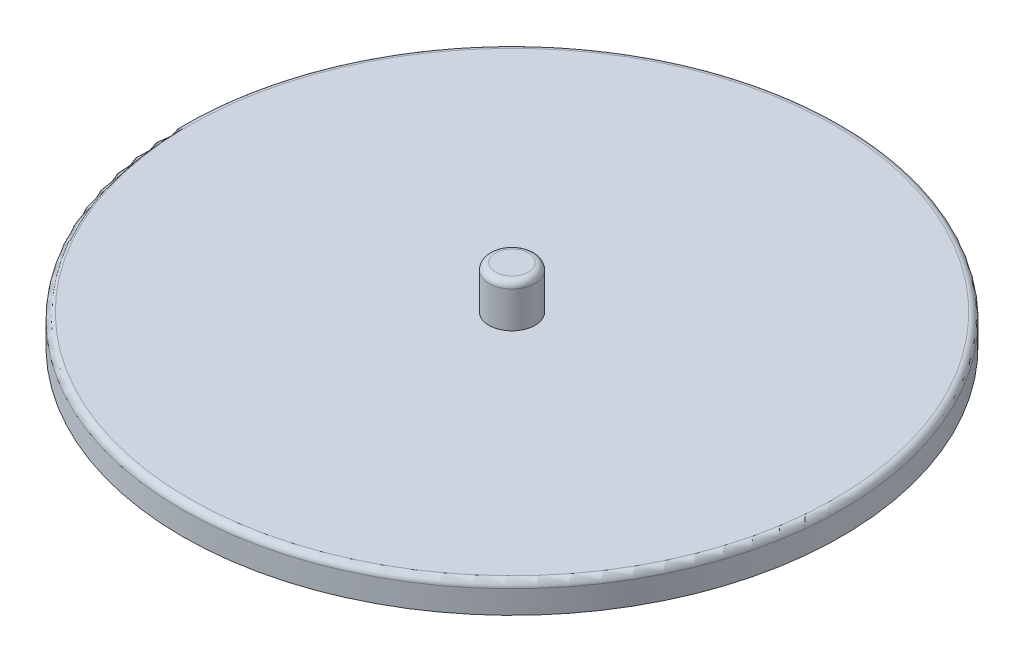
ISO-10303-21;
HEADER;
FILE_DESCRIPTION(('STEP AP214'),'2;1');
FILE_NAME('part.step','',(''),(''),'','','');
FILE_SCHEMA(('AUTOMOTIVE_DESIGN { 1 0 10303 214 1 1 1 1 }'));
ENDSEC;
DATA;
#1=APPLICATION_CONTEXT('core data for automotive mechanical design processes');
#2=APPLICATION_PROTOCOL_DEFINITION('international standard','automotive_design',2000,#1);
#3=PRODUCT_CONTEXT('',#1,'mechanical');
#4=PRODUCT('Part','Part','',(#3));
#5=PRODUCT_RELATED_PRODUCT_CATEGORY('part','',(#4));
#6=PRODUCT_DEFINITION_FORMATION('','',#4);
#7=PRODUCT_DEFINITION_CONTEXT('part definition',#1,'design');
#8=PRODUCT_DEFINITION('design','',#6,#7);
#9=PRODUCT_DEFINITION_SHAPE('','',#8);
#10=(LENGTH_UNIT() NAMED_UNIT(*) SI_UNIT(.MILLI.,.METRE.));
#11=(NAMED_UNIT(*) PLANE_ANGLE_UNIT() SI_UNIT($,.RADIAN.));
#12=(NAMED_UNIT(*) SI_UNIT($,.STERADIAN.) SOLID_ANGLE_UNIT());
#13=UNCERTAINTY_MEASURE_WITH_UNIT(LENGTH_MEASURE(1.E-05),#10,'distance_accuracy_value','');
#14=(GEOMETRIC_REPRESENTATION_CONTEXT(3) GLOBAL_UNCERTAINTY_ASSIGNED_CONTEXT((#13)) GLOBAL_UNIT_ASSIGNED_CONTEXT((#10,
#11,#12)) REPRESENTATION_CONTEXT('',''));
#15=CARTESIAN_POINT('',(0.,0.,0.));
#16=DIRECTION('',(0.,0.,1.));
#17=DIRECTION('',(1.,0.,0.));
#18=AXIS2_PLACEMENT_3D('',#15,#16,#17);
#19=CARTESIAN_POINT('',(0.,9.,0.));
#20=DIRECTION('',(0.,-1.,0.));
#21=DIRECTION('',(0.,0.,-1.));
#22=AXIS2_PLACEMENT_3D('',#19,#20,#21);
#23=CYLINDRICAL_SURFACE('',#22,99.9999999999943);
#24=CARTESIAN_POINT('',(0.,7.,0.));
#25=DIRECTION('',(0.,1.,0.));
#26=DIRECTION('',(0.,0.,1.));
#27=AXIS2_PLACEMENT_3D('',#24,#25,#26);
#28=CIRCLE('',#27,99.9999999999943);
#29=CARTESIAN_POINT('',(0.,7.,99.9999999999943));
#30=VERTEX_POINT('',#29);
#31=EDGE_CURVE('E10',#30,#30,#28,.F.);
#32=ORIENTED_EDGE('',*,*,#31,.T.);
#33=EDGE_LOOP('',(#32));
#34=FACE_BOUND('',#33,.T.);
#35=CARTESIAN_POINT('',(0.,0.,0.));
#36=DIRECTION('',(0.,1.,0.));
#37=DIRECTION('',(0.,0.,1.));
#38=AXIS2_PLACEMENT_3D('',#35,#36,#37);
#39=CIRCLE('',#38,99.9999999999943);
#40=CARTESIAN_POINT('',(0.,0.,99.9999999999943));
#41=VERTEX_POINT('',#40);
#42=EDGE_CURVE('E55',#41,#41,#39,.T.);
#43=ORIENTED_EDGE('',*,*,#42,.T.);
#44=EDGE_LOOP('',(#43));
#45=FACE_BOUND('',#44,.T.);
#46=ADVANCED_FACE('F35',(#34,#45),#23,.T.);
#47=CARTESIAN_POINT('',(0.,9.,0.));
#48=DIRECTION('',(0.,1.,0.));
#49=DIRECTION('',(0.,0.,1.));
#50=AXIS2_PLACEMENT_3D('',#47,#48,#49);
#51=PLANE('',#50);
#52=CARTESIAN_POINT('',(0.,9.,0.));
#53=DIRECTION('',(0.,1.,0.));
#54=DIRECTION('',(0.,0.,1.));
#55=AXIS2_PLACEMENT_3D('',#52,#53,#54);
#56=CIRCLE('',#55,97.9999999999943);
#57=CARTESIAN_POINT('',(0.,9.,97.9999999999943));
#58=VERTEX_POINT('',#57);
#59=EDGE_CURVE('E42',#58,#58,#56,.T.);
#60=ORIENTED_EDGE('',*,*,#59,.T.);
#61=EDGE_LOOP('',(#60));
#62=FACE_BOUND('',#61,.T.);
#63=CARTESIAN_POINT('',(0.,9.,0.));
#64=DIRECTION('',(0.,1.,0.));
#65=DIRECTION('',(0.,0.,1.));
#66=AXIS2_PLACEMENT_3D('',#63,#64,#65);
#67=CIRCLE('',#66,7.);
#68=CARTESIAN_POINT('',(0.,9.,7.));
#69=VERTEX_POINT('',#68);
#70=EDGE_CURVE('E58',#69,#69,#67,.T.);
#71=ORIENTED_EDGE('',*,*,#70,.F.);
#72=EDGE_LOOP('',(#71));
#73=FACE_BOUND('',#72,.T.);
#74=ADVANCED_FACE('F64',(#62,#73),#51,.T.);
#75=CARTESIAN_POINT('',(0.,0.,0.));
#76=DIRECTION('',(0.,1.,0.));
#77=DIRECTION('',(0.,0.,1.));
#78=AXIS2_PLACEMENT_3D('',#75,#76,#77);
#79=PLANE('',#78);
#80=ORIENTED_EDGE('',*,*,#42,.F.);
#81=EDGE_LOOP('',(#80));
#82=FACE_BOUND('',#81,.T.);
#83=ADVANCED_FACE('F66',(#82),#79,.F.);
#84=CARTESIAN_POINT('',(0.,22.,0.));
#85=DIRECTION('',(0.,-1.,0.));
#86=DIRECTION('',(0.,0.,-1.));
#87=AXIS2_PLACEMENT_3D('',#84,#85,#86);
#88=CYLINDRICAL_SURFACE('',#87,7.);
#89=CARTESIAN_POINT('',(0.,20.,0.));
#90=DIRECTION('',(0.,1.,0.));
#91=DIRECTION('',(0.,0.,1.));
#92=AXIS2_PLACEMENT_3D('',#89,#90,#91);
#93=CIRCLE('',#92,7.);
#94=CARTESIAN_POINT('',(0.,20.,7.));
#95=VERTEX_POINT('',#94);
#96=EDGE_CURVE('E46',#95,#95,#93,.F.);
#97=ORIENTED_EDGE('',*,*,#96,.T.);
#98=EDGE_LOOP('',(#97));
#99=FACE_BOUND('',#98,.T.);
#100=ORIENTED_EDGE('',*,*,#70,.T.);
#101=EDGE_LOOP('',(#100));
#102=FACE_BOUND('',#101,.T.);
#103=ADVANCED_FACE('F62',(#99,#102),#88,.T.);
#104=CARTESIAN_POINT('',(0.,22.,0.));
#105=DIRECTION('',(0.,1.,0.));
#106=DIRECTION('',(0.,0.,1.));
#107=AXIS2_PLACEMENT_3D('',#104,#105,#106);
#108=PLANE('',#107);
#109=CARTESIAN_POINT('',(0.,22.,0.));
#110=DIRECTION('',(0.,1.,0.));
#111=DIRECTION('',(0.,0.,1.));
#112=AXIS2_PLACEMENT_3D('',#109,#110,#111);
#113=CIRCLE('',#112,5.);
#114=CARTESIAN_POINT('',(0.,22.,5.));
#115=VERTEX_POINT('',#114);
#116=EDGE_CURVE('E50',#115,#115,#113,.T.);
#117=ORIENTED_EDGE('',*,*,#116,.T.);
#118=EDGE_LOOP('',(#117));
#119=FACE_BOUND('',#118,.T.);
#120=ADVANCED_FACE('F79',(#119),#108,.T.);
#121=CARTESIAN_POINT('',(0.,20.,0.));
#122=DIRECTION('',(0.,1.,0.));
#123=DIRECTION('',(0.,0.,1.));
#124=AXIS2_PLACEMENT_3D('',#121,#122,#123);
#125=TOROIDAL_SURFACE('',#124,5.,2.);
#126=ORIENTED_EDGE('',*,*,#96,.F.);
#127=EDGE_LOOP('',(#126));
#128=FACE_BOUND('',#127,.T.);
#129=ORIENTED_EDGE('',*,*,#116,.F.);
#130=EDGE_LOOP('',(#129));
#131=FACE_BOUND('',#130,.T.);
#132=ADVANCED_FACE('F77',(#128,#131),#125,.T.);
#133=CARTESIAN_POINT('',(0.,7.,0.));
#134=DIRECTION('',(0.,1.,0.));
#135=DIRECTION('',(0.,0.,1.));
#136=AXIS2_PLACEMENT_3D('',#133,#134,#135);
#137=TOROIDAL_SURFACE('',#136,97.9999999999943,2.);
#138=ORIENTED_EDGE('',*,*,#31,.F.);
#139=EDGE_LOOP('',(#138));
#140=FACE_BOUND('',#139,.T.);
#141=ORIENTED_EDGE('',*,*,#59,.F.);
#142=EDGE_LOOP('',(#141));
#143=FACE_BOUND('',#142,.T.);
#144=ADVANCED_FACE('F37',(#140,#143),#137,.T.);
#145=CLOSED_SHELL('',(#46,#74,#83,#103,#120,#132,#144));
#146=MANIFOLD_SOLID_BREP('B2',#145);
#147=ADVANCED_BREP_SHAPE_REPRESENTATION('',(#18,#146),#14);
#148=SHAPE_DEFINITION_REPRESENTATION(#9,#147);
ENDSEC;
END-ISO-10303-21;
